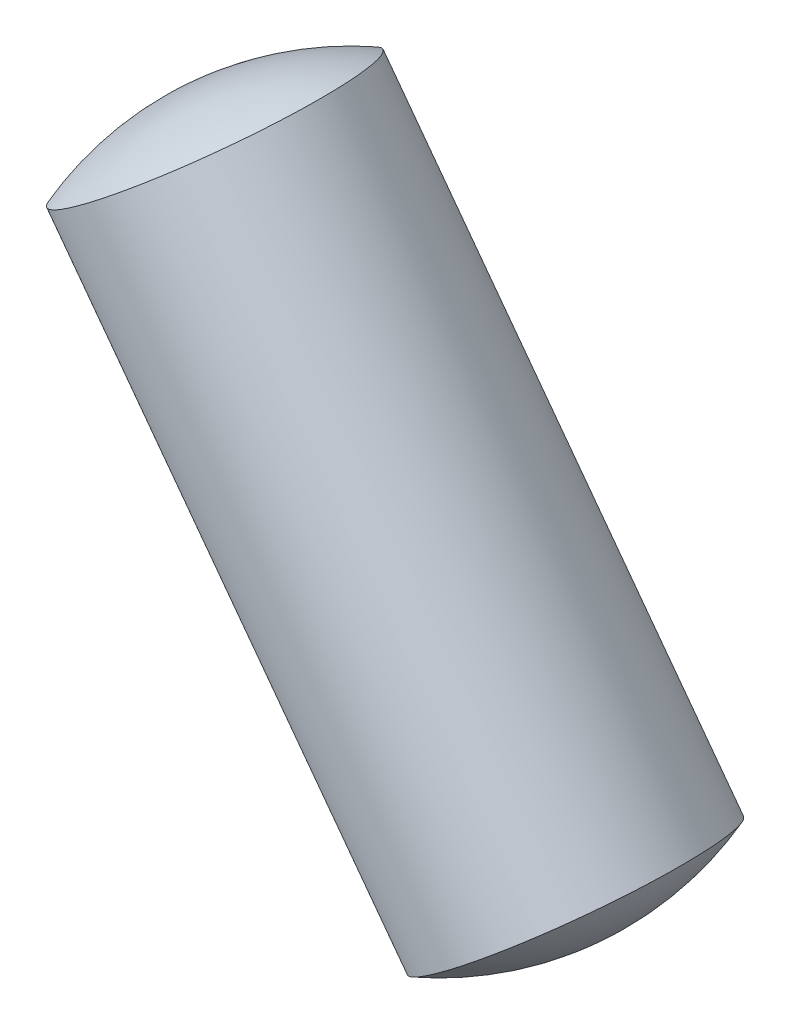
ISO-10303-21;
HEADER;
FILE_DESCRIPTION(('STEP AP214'),'2;1');
FILE_NAME('part.step','',(''),(''),'','','');
FILE_SCHEMA(('AUTOMOTIVE_DESIGN { 1 0 10303 214 1 1 1 1 }'));
ENDSEC;
DATA;
#1=APPLICATION_CONTEXT('core data for automotive mechanical design processes');
#2=APPLICATION_PROTOCOL_DEFINITION('international standard','automotive_design',2000,#1);
#3=PRODUCT_CONTEXT('',#1,'mechanical');
#4=PRODUCT('Part','Part','',(#3));
#5=PRODUCT_RELATED_PRODUCT_CATEGORY('part','',(#4));
#6=PRODUCT_DEFINITION_FORMATION('','',#4);
#7=PRODUCT_DEFINITION_CONTEXT('part definition',#1,'design');
#8=PRODUCT_DEFINITION('design','',#6,#7);
#9=PRODUCT_DEFINITION_SHAPE('','',#8);
#10=(LENGTH_UNIT() NAMED_UNIT(*) SI_UNIT(.MILLI.,.METRE.));
#11=(NAMED_UNIT(*) PLANE_ANGLE_UNIT() SI_UNIT($,.RADIAN.));
#12=(NAMED_UNIT(*) SI_UNIT($,.STERADIAN.) SOLID_ANGLE_UNIT());
#13=UNCERTAINTY_MEASURE_WITH_UNIT(LENGTH_MEASURE(1.E-05),#10,'distance_accuracy_value','');
#14=(GEOMETRIC_REPRESENTATION_CONTEXT(3) GLOBAL_UNCERTAINTY_ASSIGNED_CONTEXT((#13)) GLOBAL_UNIT_ASSIGNED_CONTEXT((#10,
#11,#12)) REPRESENTATION_CONTEXT('',''));
#15=CARTESIAN_POINT('',(0.,0.,0.));
#16=DIRECTION('',(0.,0.,1.));
#17=DIRECTION('',(1.,0.,0.));
#18=AXIS2_PLACEMENT_3D('',#15,#16,#17);
#19=CARTESIAN_POINT('',(13.3267473788863,-17.8959633985812,0.6));
#20=DIRECTION('',(-0.802043837604928,-0.597265169384555,0.));
#21=DIRECTION('',(0.597265169384556,-0.802043837604927,0.));
#22=AXIS2_PLACEMENT_3D('',#19,#20,#21);
#23=SPHERICAL_SURFACE('',#22,2.);
#24=CARTESIAN_POINT('',(13.3267473788863,-17.8959633985812,0.6));
#25=DIRECTION('',(-0.597265169384556,0.802043837604927,0.));
#26=DIRECTION('',(0.,0.,-1.));
#27=AXIS2_PLACEMENT_3D('',#24,#25,#26);
#28=SPHERICAL_SURFACE('',#27,2.);
#29=CARTESIAN_POINT('',(14.3612409978516,-19.2851440752104,0.599999999999989));
#30=DIRECTION('',(-0.597265169384556,0.802043837604927,0.));
#31=DIRECTION('',(0.,0.,-1.));
#32=AXIS2_PLACEMENT_3D('',#29,#30,#31);
#33=CIRCLE('',#32,1.);
#34=CARTESIAN_POINT('',(14.3612409978516,-19.2851440752104,-0.400000000000011));
#35=VERTEX_POINT('',#34);
#36=EDGE_CURVE('E11',#35,#35,#33,.T.);
#37=ORIENTED_EDGE('',*,*,#36,.F.);
#38=EDGE_LOOP('',(#37));
#39=FACE_BOUND('',#38,.T.);
#40=ADVANCED_FACE('F17',(#39),#28,.T.);
#41=CARTESIAN_POINT('',(12.6542874893418,-16.9929435372332,0.599999999999989));
#42=DIRECTION('',(-0.802043837604928,-0.597265169384555,0.));
#43=DIRECTION('',(-0.597265169384556,0.802043837604927,0.));
#44=AXIS2_PLACEMENT_3D('',#41,#42,#43);
#45=SPHERICAL_SURFACE('',#44,2.);
#46=CARTESIAN_POINT('',(12.6542874893418,-16.9929435372332,0.599999999999989));
#47=DIRECTION('',(-0.597265169384556,0.802043837604927,0.));
#48=DIRECTION('',(0.,0.,-1.));
#49=AXIS2_PLACEMENT_3D('',#46,#47,#48);
#50=SPHERICAL_SURFACE('',#49,2.);
#51=CARTESIAN_POINT('',(11.6197938703765,-15.6037628606039,0.599999999999989));
#52=DIRECTION('',(-0.597265169384556,0.802043837604927,0.));
#53=DIRECTION('',(0.,0.,-1.));
#54=AXIS2_PLACEMENT_3D('',#51,#52,#53);
#55=CIRCLE('',#54,1.);
#56=CARTESIAN_POINT('',(11.6197938703765,-15.6037628606039,-0.400000000000011));
#57=VERTEX_POINT('',#56);
#58=EDGE_CURVE('E21',#57,#57,#55,.T.);
#59=ORIENTED_EDGE('',*,*,#58,.T.);
#60=EDGE_LOOP('',(#59));
#61=FACE_BOUND('',#60,.T.);
#62=ADVANCED_FACE('F19',(#61),#50,.T.);
#63=CARTESIAN_POINT('',(12.3051556522453,-16.5241081642555,0.599999999999989));
#64=DIRECTION('',(-0.597265169384556,0.802043837604927,0.));
#65=DIRECTION('',(0.,0.,-1.));
#66=AXIS2_PLACEMENT_3D('',#63,#64,#65);
#67=CYLINDRICAL_SURFACE('',#66,1.);
#68=ORIENTED_EDGE('',*,*,#36,.T.);
#69=EDGE_LOOP('',(#68));
#70=FACE_BOUND('',#69,.T.);
#71=ORIENTED_EDGE('',*,*,#58,.F.);
#72=EDGE_LOOP('',(#71));
#73=FACE_BOUND('',#72,.T.);
#74=ADVANCED_FACE('F47',(#70,#73),#67,.T.);
#75=CLOSED_SHELL('',(#40,#62,#74));
#76=MANIFOLD_SOLID_BREP('B1',#75);
#77=ADVANCED_BREP_SHAPE_REPRESENTATION('',(#18,#76),#14);
#78=SHAPE_DEFINITION_REPRESENTATION(#9,#77);
ENDSEC;
END-ISO-10303-21;
